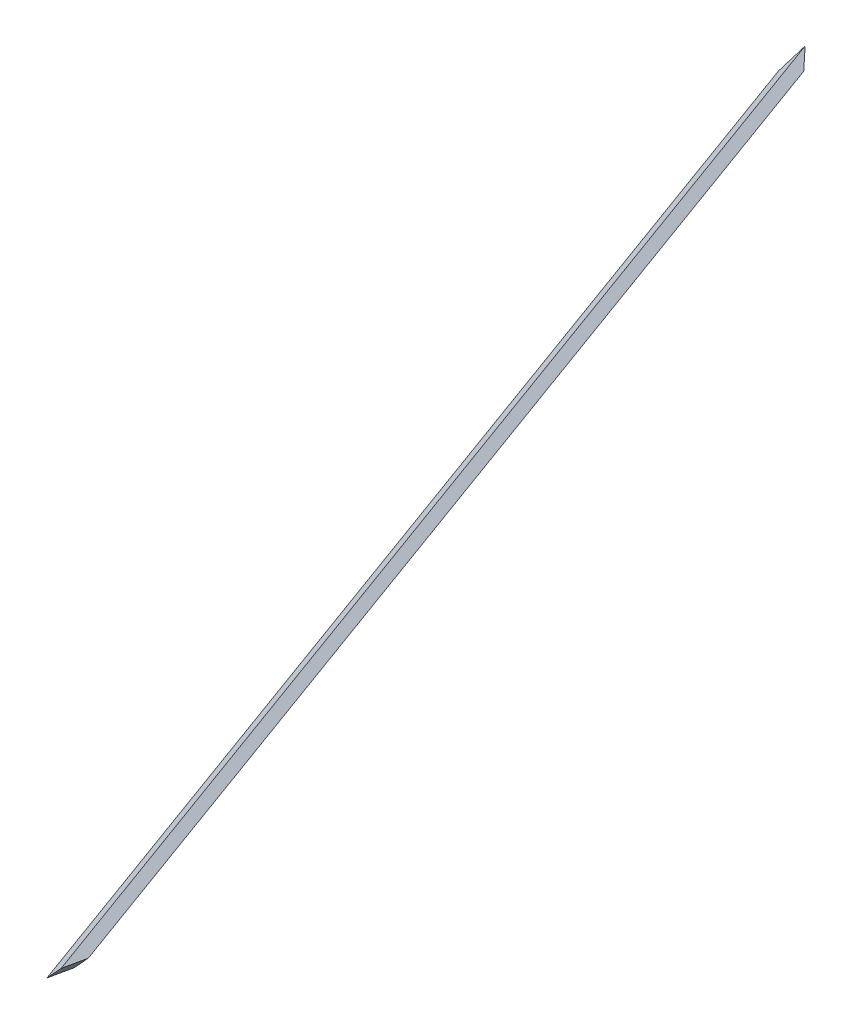
ISO-10303-21;
HEADER;
FILE_DESCRIPTION(('STEP AP214'),'2;1');
FILE_NAME('part.step','',(''),(''),'','','');
FILE_SCHEMA(('AUTOMOTIVE_DESIGN { 1 0 10303 214 1 1 1 1 }'));
ENDSEC;
DATA;
#1=APPLICATION_CONTEXT('core data for automotive mechanical design processes');
#2=APPLICATION_PROTOCOL_DEFINITION('international standard','automotive_design',2000,#1);
#3=PRODUCT_CONTEXT('',#1,'mechanical');
#4=PRODUCT('Part','Part','',(#3));
#5=PRODUCT_RELATED_PRODUCT_CATEGORY('part','',(#4));
#6=PRODUCT_DEFINITION_FORMATION('','',#4);
#7=PRODUCT_DEFINITION_CONTEXT('part definition',#1,'design');
#8=PRODUCT_DEFINITION('design','',#6,#7);
#9=PRODUCT_DEFINITION_SHAPE('','',#8);
#10=(LENGTH_UNIT() NAMED_UNIT(*) SI_UNIT(.MILLI.,.METRE.));
#11=(NAMED_UNIT(*) PLANE_ANGLE_UNIT() SI_UNIT($,.RADIAN.));
#12=(NAMED_UNIT(*) SI_UNIT($,.STERADIAN.) SOLID_ANGLE_UNIT());
#13=UNCERTAINTY_MEASURE_WITH_UNIT(LENGTH_MEASURE(1.E-05),#10,'distance_accuracy_value','');
#14=(GEOMETRIC_REPRESENTATION_CONTEXT(3) GLOBAL_UNCERTAINTY_ASSIGNED_CONTEXT((#13)) GLOBAL_UNIT_ASSIGNED_CONTEXT((#10,
#11,#12)) REPRESENTATION_CONTEXT('',''));
#15=CARTESIAN_POINT('',(0.,0.,0.));
#16=DIRECTION('',(0.,0.,1.));
#17=DIRECTION('',(1.,0.,0.));
#18=AXIS2_PLACEMENT_3D('',#15,#16,#17);
#19=CARTESIAN_POINT('',(18.7443182509818,-14.3193849518602,-7.66420929418204));
#20=DIRECTION('',(0.755761314076171,-0.577350269189627,-0.309016994374945));
#21=DIRECTION('',(0.607061998206687,0.794654472291766,0.));
#22=AXIS2_PLACEMENT_3D('',#19,#20,#21);
#23=PLANE('',#22);
#24=DIRECTION('',(0.654469130781616,0.681969712719898,0.326477361828803));
#25=VECTOR('',#24,1.);
#26=CARTESIAN_POINT('',(4036.09562606041,4194.08441603373,1954.80273322674));
#27=LINE('',#26,#25);
#28=CARTESIAN_POINT('',(4036.09562606041,4194.08441603373,1954.80273322674));
#29=VERTEX_POINT('',#28);
#30=CARTESIAN_POINT('',(4103.0908920577,4263.89480151547,1988.2228544656));
#31=VERTEX_POINT('',#30);
#32=EDGE_CURVE('E54',#29,#31,#27,.T.);
#33=ORIENTED_EDGE('',*,*,#32,.F.);
#34=DIRECTION('',(-0.13598687980085,0.323235091915078,-0.936497006870113));
#35=VECTOR('',#34,1.);
#36=CARTESIAN_POINT('',(4036.09562606041,4194.08441603373,1954.80273322674));
#37=LINE('',#36,#35);
#38=CARTESIAN_POINT('',(3755.8440191791,4860.23069457393,24.8019022697601));
#39=VERTEX_POINT('',#38);
#40=EDGE_CURVE('E73',#29,#39,#37,.T.);
#41=ORIENTED_EDGE('',*,*,#40,.T.);
#42=DIRECTION('',(0.607061998206702,0.794654472291754,0.));
#43=VECTOR('',#42,1.);
#44=CARTESIAN_POINT('',(3755.84401917911,4860.23069457393,24.8019022697561));
#45=LINE('',#44,#43);
#46=CARTESIAN_POINT('',(3817.98641541118,4941.57614731291,24.8019022697607));
#47=VERTEX_POINT('',#46);
#48=EDGE_CURVE('E65',#39,#47,#45,.T.);
#49=ORIENTED_EDGE('',*,*,#48,.T.);
#50=DIRECTION('',(0.135986879800849,-0.323235091915077,0.936497006870113));
#51=VECTOR('',#50,1.);
#52=CARTESIAN_POINT('',(3817.98641541119,4941.57614731291,24.8019022697572));
#53=LINE('',#52,#51);
#54=EDGE_CURVE('E19',#47,#31,#53,.T.);
#55=ORIENTED_EDGE('',*,*,#54,.T.);
#56=EDGE_LOOP('',(#33,#41,#49,#55));
#57=FACE_BOUND('',#56,.T.);
#58=ADVANCED_FACE('F16',(#57),#23,.T.);
#59=CARTESIAN_POINT('',(4462.52945292275,4101.24369186693,767.562971489655));
#60=DIRECTION('',(-0.730448811768304,-0.671311778017372,-0.125638489649577));
#61=DIRECTION('',(0.676673678812601,-0.736283051823292,0.));
#62=AXIS2_PLACEMENT_3D('',#59,#60,#61);
#63=PLANE('',#62);
#64=ORIENTED_EDGE('',*,*,#54,.F.);
#65=DIRECTION('',(-0.498272048507419,0.649629504367773,-0.57420072512241));
#66=VECTOR('',#65,1.);
#67=CARTESIAN_POINT('',(3817.98641541119,4941.57614731291,24.8019022697572));
#68=LINE('',#67,#66);
#69=CARTESIAN_POINT('',(3796.46416002181,4969.63610400396,-8.35729119773724E-12));
#70=VERTEX_POINT('',#69);
#71=EDGE_CURVE('E77',#47,#70,#68,.T.);
#72=ORIENTED_EDGE('',*,*,#71,.T.);
#73=DIRECTION('',(0.135986879800863,-0.323235091915094,0.936497006870106));
#74=VECTOR('',#73,1.);
#75=CARTESIAN_POINT('',(3796.46416002181,4969.63610400396,-6.80177070853069E-12));
#76=LINE('',#75,#74);
#77=CARTESIAN_POINT('',(4092.94043473807,4264.92447264006,2041.73479299146));
#78=VERTEX_POINT('',#77);
#79=EDGE_CURVE('E71',#70,#78,#76,.T.);
#80=ORIENTED_EDGE('',*,*,#79,.T.);
#81=DIRECTION('',(-0.186329447477935,0.0189014194815958,0.982305488808929));
#82=VECTOR('',#81,1.);
#83=CARTESIAN_POINT('',(4103.0908920577,4263.89480151547,1988.2228544656));
#84=LINE('',#83,#82);
#85=EDGE_CURVE('E61',#31,#78,#84,.T.);
#86=ORIENTED_EDGE('',*,*,#85,.F.);
#87=EDGE_LOOP('',(#64,#72,#80,#86));
#88=FACE_BOUND('',#87,.T.);
#89=ADVANCED_FACE('F70',(#88),#63,.F.);
#90=CARTESIAN_POINT('',(0.,0.,0.));
#91=DIRECTION('',(0.67911581020158,-0.720031948532649,0.142673436303081));
#92=DIRECTION('',(0.727474142160718,0.686135097839723,0.));
#93=AXIS2_PLACEMENT_3D('',#90,#91,#92);
#94=PLANE('',#93);
#95=DIRECTION('',(-0.654469130781615,-0.68196971271982,-0.326477361828968));
#96=VECTOR('',#95,1.);
#97=CARTESIAN_POINT('',(4092.94043473807,4264.92447264006,2041.73479299146));
#98=LINE('',#97,#96);
#99=CARTESIAN_POINT('',(4025.94516874078,4195.11408715832,2008.31467175258));
#100=VERTEX_POINT('',#99);
#101=EDGE_CURVE('E82',#78,#100,#98,.T.);
#102=ORIENTED_EDGE('',*,*,#101,.T.);
#103=DIRECTION('',(0.186329447478017,-0.018901419481715,-0.982305488808911));
#104=VECTOR('',#103,1.);
#105=CARTESIAN_POINT('',(4025.94516874078,4195.11408715832,2008.31467175258));
#106=LINE('',#105,#104);
#107=EDGE_CURVE('E63',#100,#29,#106,.T.);
#108=ORIENTED_EDGE('',*,*,#107,.T.);
#109=ORIENTED_EDGE('',*,*,#32,.T.);
#110=ORIENTED_EDGE('',*,*,#85,.T.);
#111=EDGE_LOOP('',(#102,#108,#109,#110));
#112=FACE_BOUND('',#111,.T.);
#113=ADVANCED_FACE('F59',(#112),#94,.T.);
#114=CARTESIAN_POINT('',(4389.48457174591,4034.1125140652,754.999122524693));
#115=DIRECTION('',(0.730448811768304,0.671311778017372,0.125638489649576));
#116=DIRECTION('',(-0.676673678812601,0.736283051823292,0.));
#117=AXIS2_PLACEMENT_3D('',#114,#115,#116);
#118=PLANE('',#117);
#119=ORIENTED_EDGE('',*,*,#107,.F.);
#120=DIRECTION('',(-0.135986879800865,0.323235091915092,-0.936497006870106));
#121=VECTOR('',#120,1.);
#122=CARTESIAN_POINT('',(4025.94516874078,4195.11408715832,2008.31467175258));
#123=LINE('',#122,#121);
#124=CARTESIAN_POINT('',(3734.32176378973,4888.29065126496,-5.88581009160541E-12));
#125=VERTEX_POINT('',#124);
#126=EDGE_CURVE('E25',#100,#125,#123,.T.);
#127=ORIENTED_EDGE('',*,*,#126,.T.);
#128=DIRECTION('',(0.498272048507444,-0.649629504367752,0.574200725122413));
#129=VECTOR('',#128,1.);
#130=CARTESIAN_POINT('',(3734.32176378974,4888.29065126496,-2.30926389122033E-11));
#131=LINE('',#130,#129);
#132=EDGE_CURVE('E33',#125,#39,#131,.T.);
#133=ORIENTED_EDGE('',*,*,#132,.T.);
#134=ORIENTED_EDGE('',*,*,#40,.F.);
#135=EDGE_LOOP('',(#119,#127,#133,#134));
#136=FACE_BOUND('',#135,.T.);
#137=ADVANCED_FACE('F87',(#136),#118,.F.);
#138=CARTESIAN_POINT('',(0.,0.,0.));
#139=DIRECTION('',(-0.467086179481356,0.356822089773095,0.809016994374946));
#140=DIRECTION('',(0.866025403784439,0.,0.5));
#141=AXIS2_PLACEMENT_3D('',#138,#139,#140);
#142=PLANE('',#141);
#143=ORIENTED_EDGE('',*,*,#132,.F.);
#144=DIRECTION('',(0.607061998206687,0.794654472291765,0.));
#145=VECTOR('',#144,1.);
#146=CARTESIAN_POINT('',(0.,0.,0.));
#147=LINE('',#146,#145);
#148=EDGE_CURVE('E11',#125,#70,#147,.T.);
#149=ORIENTED_EDGE('',*,*,#148,.T.);
#150=ORIENTED_EDGE('',*,*,#71,.F.);
#151=ORIENTED_EDGE('',*,*,#48,.F.);
#152=EDGE_LOOP('',(#143,#149,#150,#151));
#153=FACE_BOUND('',#152,.T.);
#154=ADVANCED_FACE('F90',(#153),#142,.F.);
#155=CARTESIAN_POINT('',(0.,0.,0.));
#156=DIRECTION('',(0.755761314076171,-0.577350269189627,-0.309016994374945));
#157=DIRECTION('',(0.607061998206687,0.794654472291765,0.));
#158=AXIS2_PLACEMENT_3D('',#155,#156,#157);
#159=PLANE('',#158);
#160=ORIENTED_EDGE('',*,*,#126,.F.);
#161=ORIENTED_EDGE('',*,*,#101,.F.);
#162=ORIENTED_EDGE('',*,*,#79,.F.);
#163=ORIENTED_EDGE('',*,*,#148,.F.);
#164=EDGE_LOOP('',(#160,#161,#162,#163));
#165=FACE_BOUND('',#164,.T.);
#166=ADVANCED_FACE('F89',(#165),#159,.F.);
#167=CLOSED_SHELL('',(#58,#89,#113,#137,#154,#166));
#168=MANIFOLD_SOLID_BREP('B1',#167);
#169=ADVANCED_BREP_SHAPE_REPRESENTATION('',(#18,#168),#14);
#170=SHAPE_DEFINITION_REPRESENTATION(#9,#169);
ENDSEC;
END-ISO-10303-21;
